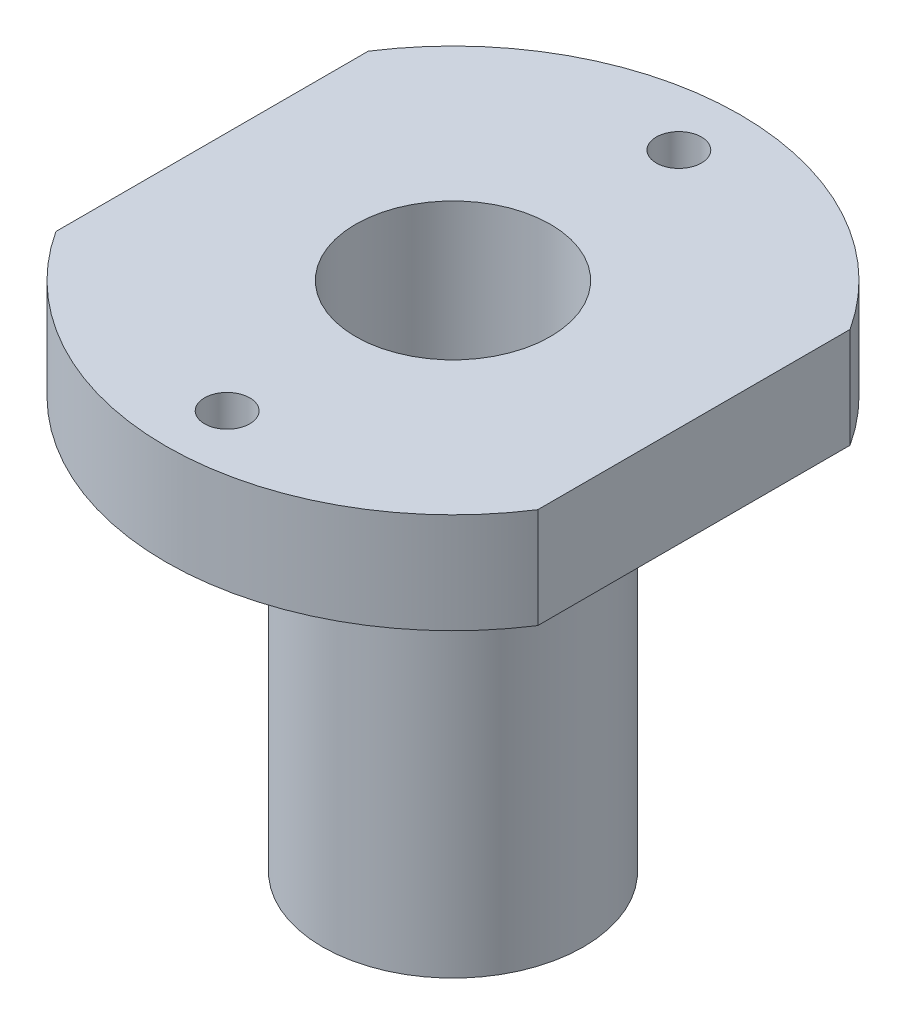
ISO-10303-21;
HEADER;
FILE_DESCRIPTION(('STEP AP214'),'2;1');
FILE_NAME('part.step','',(''),(''),'','','');
FILE_SCHEMA(('AUTOMOTIVE_DESIGN { 1 0 10303 214 1 1 1 1 }'));
ENDSEC;
DATA;
#1=APPLICATION_CONTEXT('core data for automotive mechanical design processes');
#2=APPLICATION_PROTOCOL_DEFINITION('international standard','automotive_design',2000,#1);
#3=PRODUCT_CONTEXT('',#1,'mechanical');
#4=PRODUCT('Part','Part','',(#3));
#5=PRODUCT_RELATED_PRODUCT_CATEGORY('part','',(#4));
#6=PRODUCT_DEFINITION_FORMATION('','',#4);
#7=PRODUCT_DEFINITION_CONTEXT('part definition',#1,'design');
#8=PRODUCT_DEFINITION('design','',#6,#7);
#9=PRODUCT_DEFINITION_SHAPE('','',#8);
#10=(LENGTH_UNIT() NAMED_UNIT(*) SI_UNIT(.MILLI.,.METRE.));
#11=(NAMED_UNIT(*) PLANE_ANGLE_UNIT() SI_UNIT($,.RADIAN.));
#12=(NAMED_UNIT(*) SI_UNIT($,.STERADIAN.) SOLID_ANGLE_UNIT());
#13=UNCERTAINTY_MEASURE_WITH_UNIT(LENGTH_MEASURE(1.E-05),#10,'distance_accuracy_value','');
#14=(GEOMETRIC_REPRESENTATION_CONTEXT(3) GLOBAL_UNCERTAINTY_ASSIGNED_CONTEXT((#13)) GLOBAL_UNIT_ASSIGNED_CONTEXT((#10,
#11,#12)) REPRESENTATION_CONTEXT('',''));
#15=CARTESIAN_POINT('',(0.,0.,0.));
#16=DIRECTION('',(0.,0.,1.));
#17=DIRECTION('',(1.,0.,0.));
#18=AXIS2_PLACEMENT_3D('',#15,#16,#17);
#19=CARTESIAN_POINT('',(0.,5.,0.));
#20=DIRECTION('',(0.,-1.,0.));
#21=DIRECTION('',(0.,0.,-1.));
#22=AXIS2_PLACEMENT_3D('',#19,#20,#21);
#23=CYLINDRICAL_SURFACE('',#22,14.3);
#24=DIRECTION('',(0.,-1.,0.));
#25=VECTOR('',#24,1.);
#26=CARTESIAN_POINT('',(-12.,5.,-7.7775317421403));
#27=LINE('',#26,#25);
#28=CARTESIAN_POINT('',(-12.,5.,-7.7775317421403));
#29=VERTEX_POINT('',#28);
#30=CARTESIAN_POINT('',(-12.,0.,-7.7775317421403));
#31=VERTEX_POINT('',#30);
#32=EDGE_CURVE('E45',#29,#31,#27,.T.);
#33=ORIENTED_EDGE('',*,*,#32,.F.);
#34=CARTESIAN_POINT('',(0.,5.,0.));
#35=DIRECTION('',(0.,1.,0.));
#36=DIRECTION('',(0.,0.,1.));
#37=AXIS2_PLACEMENT_3D('',#34,#35,#36);
#38=CIRCLE('',#37,14.3);
#39=CARTESIAN_POINT('',(12.,5.,-7.77753174214031));
#40=VERTEX_POINT('',#39);
#41=EDGE_CURVE('E82',#40,#29,#38,.T.);
#42=ORIENTED_EDGE('',*,*,#41,.F.);
#43=DIRECTION('',(0.,-1.,0.));
#44=VECTOR('',#43,1.);
#45=CARTESIAN_POINT('',(12.,5.,-7.77753174214031));
#46=LINE('',#45,#44);
#47=CARTESIAN_POINT('',(12.,0.,-7.77753174214031));
#48=VERTEX_POINT('',#47);
#49=EDGE_CURVE('E112',#40,#48,#46,.T.);
#50=ORIENTED_EDGE('',*,*,#49,.T.);
#51=CARTESIAN_POINT('',(0.,0.,0.));
#52=DIRECTION('',(0.,1.,0.));
#53=DIRECTION('',(0.,0.,1.));
#54=AXIS2_PLACEMENT_3D('',#51,#52,#53);
#55=CIRCLE('',#54,14.3);
#56=EDGE_CURVE('E84',#48,#31,#55,.T.);
#57=ORIENTED_EDGE('',*,*,#56,.T.);
#58=EDGE_LOOP('',(#33,#42,#50,#57));
#59=FACE_BOUND('',#58,.T.);
#60=ADVANCED_FACE('F32',(#59),#23,.T.);
#61=DIRECTION('',(0.,-1.,0.));
#62=VECTOR('',#61,1.);
#63=CARTESIAN_POINT('',(-12.,5.,7.77753174214031));
#64=LINE('',#63,#62);
#65=CARTESIAN_POINT('',(-12.,0.,7.77753174214031));
#66=VERTEX_POINT('',#65);
#67=CARTESIAN_POINT('',(-12.,5.,7.77753174214031));
#68=VERTEX_POINT('',#67);
#69=EDGE_CURVE('E73',#66,#68,#64,.F.);
#70=ORIENTED_EDGE('',*,*,#69,.F.);
#71=CARTESIAN_POINT('',(12.,0.,7.77753174214031));
#72=VERTEX_POINT('',#71);
#73=EDGE_CURVE('E53',#66,#72,#55,.T.);
#74=ORIENTED_EDGE('',*,*,#73,.T.);
#75=DIRECTION('',(0.,-1.,0.));
#76=VECTOR('',#75,1.);
#77=CARTESIAN_POINT('',(12.,5.,7.77753174214031));
#78=LINE('',#77,#76);
#79=CARTESIAN_POINT('',(12.,5.,7.77753174214031));
#80=VERTEX_POINT('',#79);
#81=EDGE_CURVE('E113',#72,#80,#78,.F.);
#82=ORIENTED_EDGE('',*,*,#81,.T.);
#83=EDGE_CURVE('E91',#68,#80,#38,.T.);
#84=ORIENTED_EDGE('',*,*,#83,.F.);
#85=EDGE_LOOP('',(#70,#74,#82,#84));
#86=FACE_BOUND('',#85,.T.);
#87=ADVANCED_FACE('F132',(#86),#23,.T.);
#88=CARTESIAN_POINT('',(0.,5.,0.));
#89=DIRECTION('',(0.,1.,0.));
#90=DIRECTION('',(0.,0.,1.));
#91=AXIS2_PLACEMENT_3D('',#88,#89,#90);
#92=PLANE('',#91);
#93=CARTESIAN_POINT('',(0.,5.,0.));
#94=DIRECTION('',(0.,1.,0.));
#95=DIRECTION('',(0.,0.,1.));
#96=AXIS2_PLACEMENT_3D('',#93,#94,#95);
#97=CIRCLE('',#96,4.85);
#98=CARTESIAN_POINT('',(0.,5.,4.85));
#99=VERTEX_POINT('',#98);
#100=EDGE_CURVE('E117',#99,#99,#97,.F.);
#101=ORIENTED_EDGE('',*,*,#100,.T.);
#102=EDGE_LOOP('',(#101));
#103=FACE_BOUND('',#102,.T.);
#104=CARTESIAN_POINT('',(0.,5.,-11.25));
#105=DIRECTION('',(0.,1.,0.));
#106=DIRECTION('',(0.,0.,1.));
#107=AXIS2_PLACEMENT_3D('',#104,#105,#106);
#108=CIRCLE('',#107,1.125);
#109=CARTESIAN_POINT('',(0.,5.,-10.125));
#110=VERTEX_POINT('',#109);
#111=EDGE_CURVE('E106',#110,#110,#108,.T.);
#112=ORIENTED_EDGE('',*,*,#111,.F.);
#113=EDGE_LOOP('',(#112));
#114=FACE_BOUND('',#113,.T.);
#115=CARTESIAN_POINT('',(0.,5.,11.25));
#116=DIRECTION('',(0.,1.,0.));
#117=DIRECTION('',(0.,0.,1.));
#118=AXIS2_PLACEMENT_3D('',#115,#116,#117);
#119=CIRCLE('',#118,1.125);
#120=CARTESIAN_POINT('',(0.,5.,12.375));
#121=VERTEX_POINT('',#120);
#122=EDGE_CURVE('E103',#121,#121,#119,.T.);
#123=ORIENTED_EDGE('',*,*,#122,.F.);
#124=EDGE_LOOP('',(#123));
#125=FACE_BOUND('',#124,.T.);
#126=ORIENTED_EDGE('',*,*,#41,.T.);
#127=DIRECTION('',(0.,0.,1.));
#128=VECTOR('',#127,1.);
#129=CARTESIAN_POINT('',(-12.,5.,0.));
#130=LINE('',#129,#128);
#131=EDGE_CURVE('E71',#29,#68,#130,.T.);
#132=ORIENTED_EDGE('',*,*,#131,.T.);
#133=ORIENTED_EDGE('',*,*,#83,.T.);
#134=DIRECTION('',(0.,0.,1.));
#135=VECTOR('',#134,1.);
#136=CARTESIAN_POINT('',(12.,5.,0.));
#137=LINE('',#136,#135);
#138=EDGE_CURVE('E85',#40,#80,#137,.T.);
#139=ORIENTED_EDGE('',*,*,#138,.F.);
#140=EDGE_LOOP('',(#126,#132,#133,#139));
#141=FACE_BOUND('',#140,.T.);
#142=ADVANCED_FACE('F88',(#103,#114,#125,#141),#92,.T.);
#143=CARTESIAN_POINT('',(0.,0.,0.));
#144=DIRECTION('',(0.,1.,0.));
#145=DIRECTION('',(0.,0.,1.));
#146=AXIS2_PLACEMENT_3D('',#143,#144,#145);
#147=PLANE('',#146);
#148=CARTESIAN_POINT('',(0.,0.,0.));
#149=DIRECTION('',(0.,1.,0.));
#150=DIRECTION('',(0.,0.,1.));
#151=AXIS2_PLACEMENT_3D('',#148,#149,#150);
#152=CIRCLE('',#151,6.5);
#153=CARTESIAN_POINT('',(0.,0.,6.5));
#154=VERTEX_POINT('',#153);
#155=EDGE_CURVE('E90',#154,#154,#152,.F.);
#156=ORIENTED_EDGE('',*,*,#155,.F.);
#157=EDGE_LOOP('',(#156));
#158=FACE_BOUND('',#157,.T.);
#159=CARTESIAN_POINT('',(0.,0.,11.25));
#160=DIRECTION('',(0.,1.,0.));
#161=DIRECTION('',(0.,0.,1.));
#162=AXIS2_PLACEMENT_3D('',#159,#160,#161);
#163=CIRCLE('',#162,1.125);
#164=CARTESIAN_POINT('',(0.,0.,12.375));
#165=VERTEX_POINT('',#164);
#166=EDGE_CURVE('E100',#165,#165,#163,.T.);
#167=ORIENTED_EDGE('',*,*,#166,.T.);
#168=EDGE_LOOP('',(#167));
#169=FACE_BOUND('',#168,.T.);
#170=CARTESIAN_POINT('',(0.,0.,-11.25));
#171=DIRECTION('',(0.,1.,0.));
#172=DIRECTION('',(0.,0.,1.));
#173=AXIS2_PLACEMENT_3D('',#170,#171,#172);
#174=CIRCLE('',#173,1.125);
#175=CARTESIAN_POINT('',(0.,0.,-10.125));
#176=VERTEX_POINT('',#175);
#177=EDGE_CURVE('E104',#176,#176,#174,.T.);
#178=ORIENTED_EDGE('',*,*,#177,.T.);
#179=EDGE_LOOP('',(#178));
#180=FACE_BOUND('',#179,.T.);
#181=DIRECTION('',(0.,0.,1.));
#182=VECTOR('',#181,1.);
#183=CARTESIAN_POINT('',(-12.,0.,0.));
#184=LINE('',#183,#182);
#185=EDGE_CURVE('E11',#31,#66,#184,.T.);
#186=ORIENTED_EDGE('',*,*,#185,.F.);
#187=ORIENTED_EDGE('',*,*,#56,.F.);
#188=DIRECTION('',(0.,0.,1.));
#189=VECTOR('',#188,1.);
#190=CARTESIAN_POINT('',(12.,0.,0.));
#191=LINE('',#190,#189);
#192=EDGE_CURVE('E39',#48,#72,#191,.T.);
#193=ORIENTED_EDGE('',*,*,#192,.T.);
#194=ORIENTED_EDGE('',*,*,#73,.F.);
#195=EDGE_LOOP('',(#186,#187,#193,#194));
#196=FACE_BOUND('',#195,.T.);
#197=ADVANCED_FACE('F109',(#158,#169,#180,#196),#147,.F.);
#198=CARTESIAN_POINT('',(0.,-20.5,0.));
#199=DIRECTION('',(0.,1.,0.));
#200=DIRECTION('',(0.,0.,1.));
#201=AXIS2_PLACEMENT_3D('',#198,#199,#200);
#202=CYLINDRICAL_SURFACE('',#201,6.5);
#203=CARTESIAN_POINT('',(0.,-20.5,0.));
#204=DIRECTION('',(0.,-1.,0.));
#205=DIRECTION('',(0.,0.,-1.));
#206=AXIS2_PLACEMENT_3D('',#203,#204,#205);
#207=CIRCLE('',#206,6.5);
#208=CARTESIAN_POINT('',(0.,-20.5,-6.5));
#209=VERTEX_POINT('',#208);
#210=EDGE_CURVE('E97',#209,#209,#207,.T.);
#211=ORIENTED_EDGE('',*,*,#210,.F.);
#212=EDGE_LOOP('',(#211));
#213=FACE_BOUND('',#212,.T.);
#214=ORIENTED_EDGE('',*,*,#155,.T.);
#215=EDGE_LOOP('',(#214));
#216=FACE_BOUND('',#215,.T.);
#217=ADVANCED_FACE('F139',(#213,#216),#202,.T.);
#218=CARTESIAN_POINT('',(0.,-20.5,0.));
#219=DIRECTION('',(0.,-1.,0.));
#220=DIRECTION('',(0.,0.,-1.));
#221=AXIS2_PLACEMENT_3D('',#218,#219,#220);
#222=PLANE('',#221);
#223=CARTESIAN_POINT('',(0.,-20.5,0.));
#224=DIRECTION('',(0.,-1.,0.));
#225=DIRECTION('',(0.,0.,-1.));
#226=AXIS2_PLACEMENT_3D('',#223,#224,#225);
#227=CIRCLE('',#226,4.85);
#228=CARTESIAN_POINT('',(0.,-20.5,-4.85));
#229=VERTEX_POINT('',#228);
#230=EDGE_CURVE('E114',#229,#229,#227,.T.);
#231=ORIENTED_EDGE('',*,*,#230,.F.);
#232=EDGE_LOOP('',(#231));
#233=FACE_BOUND('',#232,.T.);
#234=ORIENTED_EDGE('',*,*,#210,.T.);
#235=EDGE_LOOP('',(#234));
#236=FACE_BOUND('',#235,.T.);
#237=ADVANCED_FACE('F198',(#233,#236),#222,.T.);
#238=CARTESIAN_POINT('',(0.,-10.,11.25));
#239=DIRECTION('',(0.,1.,0.));
#240=DIRECTION('',(0.,0.,1.));
#241=AXIS2_PLACEMENT_3D('',#238,#239,#240);
#242=CYLINDRICAL_SURFACE('',#241,1.125);
#243=ORIENTED_EDGE('',*,*,#122,.T.);
#244=EDGE_LOOP('',(#243));
#245=FACE_BOUND('',#244,.T.);
#246=ORIENTED_EDGE('',*,*,#166,.F.);
#247=EDGE_LOOP('',(#246));
#248=FACE_BOUND('',#247,.T.);
#249=ADVANCED_FACE('F128',(#245,#248),#242,.F.);
#250=CARTESIAN_POINT('',(0.,-10.,-11.25));
#251=DIRECTION('',(0.,1.,0.));
#252=DIRECTION('',(0.,0.,1.));
#253=AXIS2_PLACEMENT_3D('',#250,#251,#252);
#254=CYLINDRICAL_SURFACE('',#253,1.125);
#255=ORIENTED_EDGE('',*,*,#111,.T.);
#256=EDGE_LOOP('',(#255));
#257=FACE_BOUND('',#256,.T.);
#258=ORIENTED_EDGE('',*,*,#177,.F.);
#259=EDGE_LOOP('',(#258));
#260=FACE_BOUND('',#259,.T.);
#261=ADVANCED_FACE('F191',(#257,#260),#254,.F.);
#262=CARTESIAN_POINT('',(0.,18.717871555019,0.));
#263=DIRECTION('',(0.,-1.,0.));
#264=DIRECTION('',(0.,0.,-1.));
#265=AXIS2_PLACEMENT_3D('',#262,#263,#264);
#266=CYLINDRICAL_SURFACE('',#265,4.85);
#267=ORIENTED_EDGE('',*,*,#230,.T.);
#268=EDGE_LOOP('',(#267));
#269=FACE_BOUND('',#268,.T.);
#270=ORIENTED_EDGE('',*,*,#100,.F.);
#271=EDGE_LOOP('',(#270));
#272=FACE_BOUND('',#271,.T.);
#273=ADVANCED_FACE('F172',(#269,#272),#266,.F.);
#274=CARTESIAN_POINT('',(12.,-5.,0.));
#275=DIRECTION('',(-1.,0.,0.));
#276=DIRECTION('',(0.,0.,1.));
#277=AXIS2_PLACEMENT_3D('',#274,#275,#276);
#278=PLANE('',#277);
#279=ORIENTED_EDGE('',*,*,#138,.T.);
#280=ORIENTED_EDGE('',*,*,#81,.F.);
#281=ORIENTED_EDGE('',*,*,#192,.F.);
#282=ORIENTED_EDGE('',*,*,#49,.F.);
#283=EDGE_LOOP('',(#279,#280,#281,#282));
#284=FACE_BOUND('',#283,.T.);
#285=ADVANCED_FACE('F111',(#284),#278,.F.);
#286=CARTESIAN_POINT('',(-12.,-5.,0.));
#287=DIRECTION('',(-1.,0.,0.));
#288=DIRECTION('',(0.,0.,1.));
#289=AXIS2_PLACEMENT_3D('',#286,#287,#288);
#290=PLANE('',#289);
#291=ORIENTED_EDGE('',*,*,#32,.T.);
#292=ORIENTED_EDGE('',*,*,#185,.T.);
#293=ORIENTED_EDGE('',*,*,#69,.T.);
#294=ORIENTED_EDGE('',*,*,#131,.F.);
#295=EDGE_LOOP('',(#291,#292,#293,#294));
#296=FACE_BOUND('',#295,.T.);
#297=ADVANCED_FACE('F72',(#296),#290,.T.);
#298=CLOSED_SHELL('',(#60,#87,#142,#197,#217,#237,#249,#261,#273,#285,#297));
#299=MANIFOLD_SOLID_BREP('B2',#298);
#300=ADVANCED_BREP_SHAPE_REPRESENTATION('',(#18,#299),#14);
#301=SHAPE_DEFINITION_REPRESENTATION(#9,#300);
ENDSEC;
END-ISO-10303-21;
